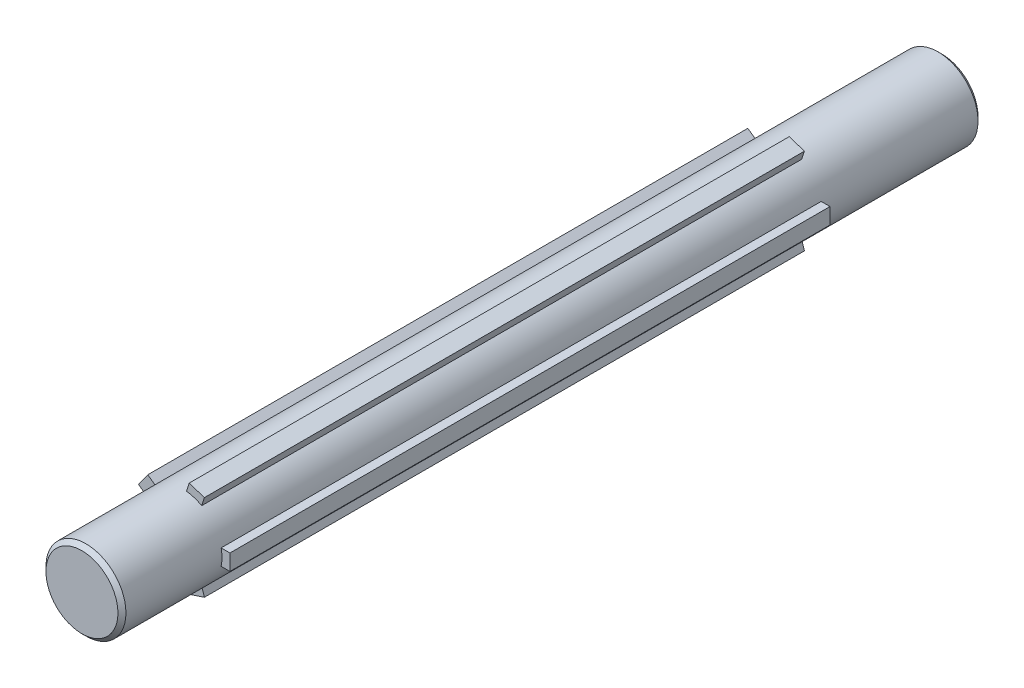
ISO-10303-21;
HEADER;
FILE_DESCRIPTION(('STEP AP214'),'2;1');
FILE_NAME('part.step','',(''),(''),'','','');
FILE_SCHEMA(('AUTOMOTIVE_DESIGN { 1 0 10303 214 1 1 1 1 }'));
ENDSEC;
DATA;
#1=APPLICATION_CONTEXT('core data for automotive mechanical design processes');
#2=APPLICATION_PROTOCOL_DEFINITION('international standard','automotive_design',2000,#1);
#3=PRODUCT_CONTEXT('',#1,'mechanical');
#4=PRODUCT('Part','Part','',(#3));
#5=PRODUCT_RELATED_PRODUCT_CATEGORY('part','',(#4));
#6=PRODUCT_DEFINITION_FORMATION('','',#4);
#7=PRODUCT_DEFINITION_CONTEXT('part definition',#1,'design');
#8=PRODUCT_DEFINITION('design','',#6,#7);
#9=PRODUCT_DEFINITION_SHAPE('','',#8);
#10=(LENGTH_UNIT() NAMED_UNIT(*) SI_UNIT(.MILLI.,.METRE.));
#11=(NAMED_UNIT(*) PLANE_ANGLE_UNIT() SI_UNIT($,.RADIAN.));
#12=(NAMED_UNIT(*) SI_UNIT($,.STERADIAN.) SOLID_ANGLE_UNIT());
#13=UNCERTAINTY_MEASURE_WITH_UNIT(LENGTH_MEASURE(1.E-05),#10,'distance_accuracy_value','');
#14=(GEOMETRIC_REPRESENTATION_CONTEXT(3) GLOBAL_UNCERTAINTY_ASSIGNED_CONTEXT((#13)) GLOBAL_UNIT_ASSIGNED_CONTEXT((#10,
#11,#12)) REPRESENTATION_CONTEXT('',''));
#15=CARTESIAN_POINT('',(0.,0.,0.));
#16=DIRECTION('',(0.,0.,1.));
#17=DIRECTION('',(1.,0.,0.));
#18=AXIS2_PLACEMENT_3D('',#15,#16,#17);
#19=CARTESIAN_POINT('',(0.,0.,190.));
#20=DIRECTION('',(0.,0.,1.));
#21=DIRECTION('',(1.,0.,0.));
#22=AXIS2_PLACEMENT_3D('',#19,#20,#21);
#23=PLANE('',#22);
#24=CARTESIAN_POINT('',(0.,0.,190.));
#25=DIRECTION('',(0.,0.,1.));
#26=DIRECTION('',(1.,0.,0.));
#27=AXIS2_PLACEMENT_3D('',#24,#25,#26);
#28=CIRCLE('',#27,10.);
#29=CARTESIAN_POINT('',(4.9298488648587,8.70037873713848,190.));
#30=VERTEX_POINT('',#29);
#31=CARTESIAN_POINT('',(1.12562279967807,9.93644671463823,190.));
#32=VERTEX_POINT('',#31);
#33=EDGE_CURVE('E280',#30,#32,#28,.T.);
#34=ORIENTED_EDGE('',*,*,#33,.F.);
#35=DIRECTION('',(0.309016994374947,0.951056516295154,0.));
#36=VECTOR('',#35,1.);
#37=CARTESIAN_POINT('',(1.90211303259021,-0.618033988749863,190.));
#38=LINE('',#37,#36);
#39=CARTESIAN_POINT('',(5.6103169650895,10.7946442067917,190.));
#40=VERTEX_POINT('',#39);
#41=EDGE_CURVE('E612',#30,#40,#38,.T.);
#42=ORIENTED_EDGE('',*,*,#41,.T.);
#43=DIRECTION('',(0.951056516295154,-0.309016994374947,0.));
#44=VECTOR('',#43,1.);
#45=CARTESIAN_POINT('',(3.70820393249929,11.4126781955416,190.));
#46=LINE('',#45,#44);
#47=CARTESIAN_POINT('',(1.80609089990888,12.0307121842915,190.));
#48=VERTEX_POINT('',#47);
#49=EDGE_CURVE('E608',#48,#40,#46,.T.);
#50=ORIENTED_EDGE('',*,*,#49,.F.);
#51=DIRECTION('',(0.309016994374947,0.951056516295154,0.));
#52=VECTOR('',#51,1.);
#53=CARTESIAN_POINT('',(-1.9021130325904,0.618033988749926,190.));
#54=LINE('',#53,#52);
#55=EDGE_CURVE('E604',#32,#48,#54,.T.);
#56=ORIENTED_EDGE('',*,*,#55,.F.);
#57=EDGE_LOOP('',(#34,#42,#50,#56));
#58=FACE_BOUND('',#57,.T.);
#59=ADVANCED_FACE('F115',(#58),#23,.T.);
#60=CARTESIAN_POINT('',(-6.75114481325018,7.37712977454818,190.));
#61=VERTEX_POINT('',#60);
#62=CARTESIAN_POINT('',(-9.10228582241994,4.1410617970483,190.));
#63=VERTEX_POINT('',#62);
#64=EDGE_CURVE('E291',#61,#63,#28,.T.);
#65=ORIENTED_EDGE('',*,*,#64,.F.);
#66=DIRECTION('',(-0.809016994374948,0.587785252292473,0.));
#67=VECTOR('',#66,1.);
#68=CARTESIAN_POINT('',(1.17557050458472,1.61803398874959,190.));
#69=LINE('',#68,#67);
#70=CARTESIAN_POINT('',(-8.53263342791445,8.67145701625913,190.));
#71=VERTEX_POINT('',#70);
#72=EDGE_CURVE('E553',#61,#71,#69,.T.);
#73=ORIENTED_EDGE('',*,*,#72,.T.);
#74=DIRECTION('',(0.587785252292473,0.809016994374948,0.));
#75=VECTOR('',#74,1.);
#76=CARTESIAN_POINT('',(-9.70820393249918,7.05342302750953,190.));
#77=LINE('',#76,#75);
#78=CARTESIAN_POINT('',(-10.8837744370843,5.43538903875934,190.));
#79=VERTEX_POINT('',#78);
#80=EDGE_CURVE('E557',#79,#71,#77,.T.);
#81=ORIENTED_EDGE('',*,*,#80,.F.);
#82=DIRECTION('',(-0.809016994374947,0.587785252292473,0.));
#83=VECTOR('',#82,1.);
#84=CARTESIAN_POINT('',(-1.17557050458517,-1.6180339887502,190.));
#85=LINE('',#84,#83);
#86=EDGE_CURVE('E562',#63,#79,#85,.T.);
#87=ORIENTED_EDGE('',*,*,#86,.F.);
#88=EDGE_LOOP('',(#65,#73,#81,#87));
#89=FACE_BOUND('',#88,.T.);
#90=ADVANCED_FACE('F442',(#89),#23,.T.);
#91=CARTESIAN_POINT('',(-9.1022858224196,-4.14106179704906,190.));
#92=VERTEX_POINT('',#91);
#93=CARTESIAN_POINT('',(-6.75114481324956,-7.37712977454874,190.));
#94=VERTEX_POINT('',#93);
#95=EDGE_CURVE('E284',#92,#94,#28,.T.);
#96=ORIENTED_EDGE('',*,*,#95,.F.);
#97=DIRECTION('',(-0.809016994374947,-0.587785252292474,0.));
#98=VECTOR('',#97,1.);
#99=CARTESIAN_POINT('',(-1.17557050458469,1.61803398874954,190.));
#100=LINE('',#99,#98);
#101=CARTESIAN_POINT('',(-10.8837744370841,-5.43538903876016,190.));
#102=VERTEX_POINT('',#101);
#103=EDGE_CURVE('E319',#92,#102,#100,.T.);
#104=ORIENTED_EDGE('',*,*,#103,.T.);
#105=DIRECTION('',(-0.587785252292473,0.809016994374947,0.));
#106=VECTOR('',#105,1.);
#107=CARTESIAN_POINT('',(-9.7082039324994,-7.05342302750969,190.));
#108=LINE('',#107,#106);
#109=CARTESIAN_POINT('',(-8.53263342791418,-8.67145701625995,190.));
#110=VERTEX_POINT('',#109);
#111=EDGE_CURVE('E324',#110,#102,#108,.T.);
#112=ORIENTED_EDGE('',*,*,#111,.F.);
#113=DIRECTION('',(-0.809016994374947,-0.587785252292473,0.));
#114=VECTOR('',#113,1.);
#115=CARTESIAN_POINT('',(1.17557050458521,-1.61803398875025,190.));
#116=LINE('',#115,#114);
#117=EDGE_CURVE('E322',#94,#110,#116,.T.);
#118=ORIENTED_EDGE('',*,*,#117,.F.);
#119=EDGE_LOOP('',(#96,#104,#112,#118));
#120=FACE_BOUND('',#119,.T.);
#121=ADVANCED_FACE('F317',(#120),#23,.T.);
#122=CARTESIAN_POINT('',(1.12562279967839,-9.93644671463819,190.));
#123=VERTEX_POINT('',#122);
#124=CARTESIAN_POINT('',(4.92984886485898,-8.70037873713832,190.));
#125=VERTEX_POINT('',#124);
#126=EDGE_CURVE('E277',#123,#125,#28,.T.);
#127=ORIENTED_EDGE('',*,*,#126,.F.);
#128=DIRECTION('',(0.309016994374948,-0.951056516295154,0.));
#129=VECTOR('',#128,1.);
#130=CARTESIAN_POINT('',(-1.90211303259011,-0.61803398874983,190.));
#131=LINE('',#130,#129);
#132=CARTESIAN_POINT('',(1.80609089990932,-12.0307121842918,190.));
#133=VERTEX_POINT('',#132);
#134=EDGE_CURVE('E356',#123,#133,#131,.T.);
#135=ORIENTED_EDGE('',*,*,#134,.T.);
#136=DIRECTION('',(-0.951056516295154,-0.309016994374948,0.));
#137=VECTOR('',#136,1.);
#138=CARTESIAN_POINT('',(3.70820393249942,-11.412678195542,190.));
#139=LINE('',#138,#137);
#140=CARTESIAN_POINT('',(5.61031696508993,-10.7946442067921,190.));
#141=VERTEX_POINT('',#140);
#142=EDGE_CURVE('E359',#141,#133,#139,.T.);
#143=ORIENTED_EDGE('',*,*,#142,.F.);
#144=DIRECTION('',(0.309016994374948,-0.951056516295154,0.));
#145=VECTOR('',#144,1.);
#146=CARTESIAN_POINT('',(1.90211303259051,0.61803398874996,190.));
#147=LINE('',#146,#145);
#148=EDGE_CURVE('E364',#125,#141,#147,.T.);
#149=ORIENTED_EDGE('',*,*,#148,.F.);
#150=EDGE_LOOP('',(#127,#135,#143,#149));
#151=FACE_BOUND('',#150,.T.);
#152=ADVANCED_FACE('F451',(#151),#23,.T.);
#153=CARTESIAN_POINT('',(0.,0.,40.));
#154=DIRECTION('',(0.,0.,-1.));
#155=DIRECTION('',(-1.,0.,0.));
#156=AXIS2_PLACEMENT_3D('',#153,#154,#155);
#157=CYLINDRICAL_SURFACE('',#156,10.);
#158=CARTESIAN_POINT('',(0.,0.,214.));
#159=DIRECTION('',(0.,0.,1.));
#160=DIRECTION('',(1.,0.,0.));
#161=AXIS2_PLACEMENT_3D('',#158,#159,#160);
#162=CIRCLE('',#161,10.);
#163=CARTESIAN_POINT('',(10.,0.,214.));
#164=VERTEX_POINT('',#163);
#165=EDGE_CURVE('E124',#164,#164,#162,.F.);
#166=ORIENTED_EDGE('',*,*,#165,.T.);
#167=EDGE_LOOP('',(#166));
#168=FACE_BOUND('',#167,.T.);
#169=CARTESIAN_POINT('',(0.,0.,0.99999999999998));
#170=DIRECTION('',(0.,0.,1.));
#171=DIRECTION('',(1.,0.,0.));
#172=AXIS2_PLACEMENT_3D('',#169,#170,#171);
#173=CIRCLE('',#172,10.);
#174=CARTESIAN_POINT('',(10.,0.,0.99999999999998));
#175=VERTEX_POINT('',#174);
#176=EDGE_CURVE('E298',#175,#175,#173,.T.);
#177=ORIENTED_EDGE('',*,*,#176,.T.);
#178=EDGE_LOOP('',(#177));
#179=FACE_BOUND('',#178,.T.);
#180=DIRECTION('',(0.,0.,-1.));
#181=VECTOR('',#180,1.);
#182=CARTESIAN_POINT('',(4.9298488648587,8.70037873713848,190.));
#183=LINE('',#182,#181);
#184=CARTESIAN_POINT('',(4.9298488648587,8.70037873713848,40.));
#185=VERTEX_POINT('',#184);
#186=EDGE_CURVE('E412',#30,#185,#183,.T.);
#187=ORIENTED_EDGE('',*,*,#186,.F.);
#188=ORIENTED_EDGE('',*,*,#33,.T.);
#189=DIRECTION('',(0.,0.,-1.));
#190=VECTOR('',#189,1.);
#191=CARTESIAN_POINT('',(1.12562279967807,9.93644671463823,190.));
#192=LINE('',#191,#190);
#193=CARTESIAN_POINT('',(1.12562279967807,9.93644671463823,40.));
#194=VERTEX_POINT('',#193);
#195=EDGE_CURVE('E601',#32,#194,#192,.T.);
#196=ORIENTED_EDGE('',*,*,#195,.T.);
#197=CARTESIAN_POINT('',(0.,0.,40.));
#198=DIRECTION('',(0.,0.,1.));
#199=DIRECTION('',(1.,0.,0.));
#200=AXIS2_PLACEMENT_3D('',#197,#198,#199);
#201=CIRCLE('',#200,10.);
#202=EDGE_CURVE('E278',#185,#194,#201,.T.);
#203=ORIENTED_EDGE('',*,*,#202,.F.);
#204=EDGE_LOOP('',(#187,#188,#196,#203));
#205=FACE_BOUND('',#204,.T.);
#206=DIRECTION('',(0.,0.,-1.));
#207=VECTOR('',#206,1.);
#208=CARTESIAN_POINT('',(-6.75114481325018,7.37712977454818,190.));
#209=LINE('',#208,#207);
#210=CARTESIAN_POINT('',(-6.75114481325018,7.37712977454818,40.));
#211=VERTEX_POINT('',#210);
#212=EDGE_CURVE('E544',#61,#211,#209,.T.);
#213=ORIENTED_EDGE('',*,*,#212,.F.);
#214=ORIENTED_EDGE('',*,*,#64,.T.);
#215=DIRECTION('',(0.,0.,-1.));
#216=VECTOR('',#215,1.);
#217=CARTESIAN_POINT('',(-9.10228582241994,4.1410617970483,190.));
#218=LINE('',#217,#216);
#219=CARTESIAN_POINT('',(-9.10228582241994,4.1410617970483,40.));
#220=VERTEX_POINT('',#219);
#221=EDGE_CURVE('E573',#63,#220,#218,.T.);
#222=ORIENTED_EDGE('',*,*,#221,.T.);
#223=EDGE_CURVE('E285',#211,#220,#201,.T.);
#224=ORIENTED_EDGE('',*,*,#223,.F.);
#225=EDGE_LOOP('',(#213,#214,#222,#224));
#226=FACE_BOUND('',#225,.T.);
#227=DIRECTION('',(0.,0.,-1.));
#228=VECTOR('',#227,1.);
#229=CARTESIAN_POINT('',(-9.1022858224196,-4.14106179704906,190.));
#230=LINE('',#229,#228);
#231=CARTESIAN_POINT('',(-9.1022858224196,-4.14106179704906,40.));
#232=VERTEX_POINT('',#231);
#233=EDGE_CURVE('E313',#92,#232,#230,.T.);
#234=ORIENTED_EDGE('',*,*,#233,.F.);
#235=ORIENTED_EDGE('',*,*,#95,.T.);
#236=DIRECTION('',(0.,0.,-1.));
#237=VECTOR('',#236,1.);
#238=CARTESIAN_POINT('',(-6.75114481324956,-7.37712977454874,190.));
#239=LINE('',#238,#237);
#240=CARTESIAN_POINT('',(-6.75114481324956,-7.37712977454874,40.));
#241=VERTEX_POINT('',#240);
#242=EDGE_CURVE('E310',#94,#241,#239,.T.);
#243=ORIENTED_EDGE('',*,*,#242,.T.);
#244=EDGE_CURVE('E591',#232,#241,#201,.T.);
#245=ORIENTED_EDGE('',*,*,#244,.F.);
#246=EDGE_LOOP('',(#234,#235,#243,#245));
#247=FACE_BOUND('',#246,.T.);
#248=DIRECTION('',(0.,0.,-1.));
#249=VECTOR('',#248,1.);
#250=CARTESIAN_POINT('',(1.12562279967839,-9.93644671463819,190.));
#251=LINE('',#250,#249);
#252=CARTESIAN_POINT('',(1.12562279967839,-9.93644671463819,40.));
#253=VERTEX_POINT('',#252);
#254=EDGE_CURVE('E340',#123,#253,#251,.T.);
#255=ORIENTED_EDGE('',*,*,#254,.F.);
#256=ORIENTED_EDGE('',*,*,#126,.T.);
#257=DIRECTION('',(0.,0.,-1.));
#258=VECTOR('',#257,1.);
#259=CARTESIAN_POINT('',(4.92984886485898,-8.70037873713832,190.));
#260=LINE('',#259,#258);
#261=CARTESIAN_POINT('',(4.92984886485898,-8.70037873713832,40.));
#262=VERTEX_POINT('',#261);
#263=EDGE_CURVE('E368',#125,#262,#260,.T.);
#264=ORIENTED_EDGE('',*,*,#263,.T.);
#265=EDGE_CURVE('E139',#253,#262,#201,.T.);
#266=ORIENTED_EDGE('',*,*,#265,.F.);
#267=EDGE_LOOP('',(#255,#256,#264,#266));
#268=FACE_BOUND('',#267,.T.);
#269=CARTESIAN_POINT('',(9.79795897113271,-2.,190.));
#270=VERTEX_POINT('',#269);
#271=CARTESIAN_POINT('',(9.79795897113271,2.,190.));
#272=VERTEX_POINT('',#271);
#273=EDGE_CURVE('E259',#270,#272,#28,.T.);
#274=ORIENTED_EDGE('',*,*,#273,.T.);
#275=DIRECTION('',(0.,0.,-1.));
#276=VECTOR('',#275,1.);
#277=CARTESIAN_POINT('',(9.79795897113271,2.,190.));
#278=LINE('',#277,#276);
#279=CARTESIAN_POINT('',(9.79795897113271,2.,40.));
#280=VERTEX_POINT('',#279);
#281=EDGE_CURVE('E264',#272,#280,#278,.T.);
#282=ORIENTED_EDGE('',*,*,#281,.T.);
#283=CARTESIAN_POINT('',(9.79795897113271,-2.,40.));
#284=VERTEX_POINT('',#283);
#285=EDGE_CURVE('E131',#284,#280,#201,.T.);
#286=ORIENTED_EDGE('',*,*,#285,.F.);
#287=DIRECTION('',(0.,0.,-1.));
#288=VECTOR('',#287,1.);
#289=CARTESIAN_POINT('',(9.79795897113271,-2.,190.));
#290=LINE('',#289,#288);
#291=EDGE_CURVE('E274',#270,#284,#290,.T.);
#292=ORIENTED_EDGE('',*,*,#291,.F.);
#293=EDGE_LOOP('',(#274,#282,#286,#292));
#294=FACE_BOUND('',#293,.T.);
#295=ADVANCED_FACE('F273',(#168,#179,#205,#226,#247,#268,#294),#157,.T.);
#296=CARTESIAN_POINT('',(0.,0.,0.));
#297=DIRECTION('',(0.,0.,1.));
#298=DIRECTION('',(1.,0.,0.));
#299=AXIS2_PLACEMENT_3D('',#296,#297,#298);
#300=PLANE('',#299);
#301=CARTESIAN_POINT('',(0.,0.,0.));
#302=DIRECTION('',(0.,0.,1.));
#303=DIRECTION('',(1.,0.,0.));
#304=AXIS2_PLACEMENT_3D('',#301,#302,#303);
#305=CIRCLE('',#304,9.00000000000001);
#306=CARTESIAN_POINT('',(9.00000000000001,0.,0.));
#307=VERTEX_POINT('',#306);
#308=EDGE_CURVE('E12',#307,#307,#305,.F.);
#309=ORIENTED_EDGE('',*,*,#308,.T.);
#310=EDGE_LOOP('',(#309));
#311=FACE_BOUND('',#310,.T.);
#312=ADVANCED_FACE('F468',(#311),#300,.F.);
#313=CARTESIAN_POINT('',(0.,0.,40.));
#314=DIRECTION('',(0.,0.,1.));
#315=DIRECTION('',(1.,0.,0.));
#316=AXIS2_PLACEMENT_3D('',#313,#314,#315);
#317=PLANE('',#316);
#318=DIRECTION('',(0.309016994374947,0.951056516295154,0.));
#319=VECTOR('',#318,1.);
#320=CARTESIAN_POINT('',(1.90211303259021,-0.618033988749863,40.));
#321=LINE('',#320,#319);
#322=CARTESIAN_POINT('',(5.6103169650895,10.7946442067917,40.));
#323=VERTEX_POINT('',#322);
#324=EDGE_CURVE('E549',#185,#323,#321,.T.);
#325=ORIENTED_EDGE('',*,*,#324,.F.);
#326=ORIENTED_EDGE('',*,*,#202,.T.);
#327=DIRECTION('',(0.309016994374947,0.951056516295154,0.));
#328=VECTOR('',#327,1.);
#329=CARTESIAN_POINT('',(-1.9021130325904,0.618033988749926,40.));
#330=LINE('',#329,#328);
#331=CARTESIAN_POINT('',(1.80609089990888,12.0307121842915,40.));
#332=VERTEX_POINT('',#331);
#333=EDGE_CURVE('E615',#194,#332,#330,.T.);
#334=ORIENTED_EDGE('',*,*,#333,.T.);
#335=DIRECTION('',(0.951056516295154,-0.309016994374947,0.));
#336=VECTOR('',#335,1.);
#337=CARTESIAN_POINT('',(3.70820393249929,11.4126781955416,40.));
#338=LINE('',#337,#336);
#339=EDGE_CURVE('E618',#332,#323,#338,.T.);
#340=ORIENTED_EDGE('',*,*,#339,.T.);
#341=EDGE_LOOP('',(#325,#326,#334,#340));
#342=FACE_BOUND('',#341,.T.);
#343=ADVANCED_FACE('F493',(#342),#317,.F.);
#344=DIRECTION('',(-0.809016994374948,0.587785252292473,0.));
#345=VECTOR('',#344,1.);
#346=CARTESIAN_POINT('',(1.17557050458472,1.61803398874959,40.));
#347=LINE('',#346,#345);
#348=CARTESIAN_POINT('',(-8.53263342791445,8.67145701625913,40.));
#349=VERTEX_POINT('',#348);
#350=EDGE_CURVE('E355',#211,#349,#347,.T.);
#351=ORIENTED_EDGE('',*,*,#350,.F.);
#352=ORIENTED_EDGE('',*,*,#223,.T.);
#353=DIRECTION('',(-0.809016994374947,0.587785252292473,0.));
#354=VECTOR('',#353,1.);
#355=CARTESIAN_POINT('',(-1.17557050458517,-1.6180339887502,40.));
#356=LINE('',#355,#354);
#357=CARTESIAN_POINT('',(-10.8837744370843,5.43538903875934,40.));
#358=VERTEX_POINT('',#357);
#359=EDGE_CURVE('E558',#220,#358,#356,.T.);
#360=ORIENTED_EDGE('',*,*,#359,.T.);
#361=DIRECTION('',(0.587785252292473,0.809016994374948,0.));
#362=VECTOR('',#361,1.);
#363=CARTESIAN_POINT('',(-9.70820393249918,7.05342302750953,40.));
#364=LINE('',#363,#362);
#365=EDGE_CURVE('E565',#358,#349,#364,.T.);
#366=ORIENTED_EDGE('',*,*,#365,.T.);
#367=EDGE_LOOP('',(#351,#352,#360,#366));
#368=FACE_BOUND('',#367,.T.);
#369=ADVANCED_FACE('F494',(#368),#317,.F.);
#370=DIRECTION('',(-0.809016994374947,-0.587785252292474,0.));
#371=VECTOR('',#370,1.);
#372=CARTESIAN_POINT('',(-1.17557050458469,1.61803398874954,40.));
#373=LINE('',#372,#371);
#374=CARTESIAN_POINT('',(-10.8837744370841,-5.43538903876016,40.));
#375=VERTEX_POINT('',#374);
#376=EDGE_CURVE('E335',#232,#375,#373,.T.);
#377=ORIENTED_EDGE('',*,*,#376,.F.);
#378=ORIENTED_EDGE('',*,*,#244,.T.);
#379=DIRECTION('',(-0.809016994374947,-0.587785252292473,0.));
#380=VECTOR('',#379,1.);
#381=CARTESIAN_POINT('',(1.17557050458521,-1.61803398875025,40.));
#382=LINE('',#381,#380);
#383=CARTESIAN_POINT('',(-8.53263342791418,-8.67145701625995,40.));
#384=VERTEX_POINT('',#383);
#385=EDGE_CURVE('E344',#241,#384,#382,.T.);
#386=ORIENTED_EDGE('',*,*,#385,.T.);
#387=DIRECTION('',(-0.587785252292473,0.809016994374947,0.));
#388=VECTOR('',#387,1.);
#389=CARTESIAN_POINT('',(-9.7082039324994,-7.05342302750969,40.));
#390=LINE('',#389,#388);
#391=EDGE_CURVE('E339',#384,#375,#390,.T.);
#392=ORIENTED_EDGE('',*,*,#391,.T.);
#393=EDGE_LOOP('',(#377,#378,#386,#392));
#394=FACE_BOUND('',#393,.T.);
#395=ADVANCED_FACE('F486',(#394),#317,.F.);
#396=DIRECTION('',(0.309016994374948,-0.951056516295154,0.));
#397=VECTOR('',#396,1.);
#398=CARTESIAN_POINT('',(-1.90211303259011,-0.61803398874983,40.));
#399=LINE('',#398,#397);
#400=CARTESIAN_POINT('',(1.80609089990932,-12.0307121842918,40.));
#401=VERTEX_POINT('',#400);
#402=EDGE_CURVE('E369',#253,#401,#399,.T.);
#403=ORIENTED_EDGE('',*,*,#402,.F.);
#404=ORIENTED_EDGE('',*,*,#265,.T.);
#405=DIRECTION('',(0.309016994374948,-0.951056516295154,0.));
#406=VECTOR('',#405,1.);
#407=CARTESIAN_POINT('',(1.90211303259051,0.61803398874996,40.));
#408=LINE('',#407,#406);
#409=CARTESIAN_POINT('',(5.61031696508993,-10.7946442067921,40.));
#410=VERTEX_POINT('',#409);
#411=EDGE_CURVE('E360',#262,#410,#408,.T.);
#412=ORIENTED_EDGE('',*,*,#411,.T.);
#413=DIRECTION('',(-0.951056516295154,-0.309016994374948,0.));
#414=VECTOR('',#413,1.);
#415=CARTESIAN_POINT('',(3.70820393249942,-11.412678195542,40.));
#416=LINE('',#415,#414);
#417=EDGE_CURVE('E373',#410,#401,#416,.T.);
#418=ORIENTED_EDGE('',*,*,#417,.T.);
#419=EDGE_LOOP('',(#403,#404,#412,#418));
#420=FACE_BOUND('',#419,.T.);
#421=ADVANCED_FACE('F483',(#420),#317,.F.);
#422=DIRECTION('',(1.,0.,0.));
#423=VECTOR('',#422,1.);
#424=CARTESIAN_POINT('',(0.,-2.,40.));
#425=LINE('',#424,#423);
#426=CARTESIAN_POINT('',(12.,-2.,40.));
#427=VERTEX_POINT('',#426);
#428=EDGE_CURVE('E395',#284,#427,#425,.T.);
#429=ORIENTED_EDGE('',*,*,#428,.F.);
#430=ORIENTED_EDGE('',*,*,#285,.T.);
#431=DIRECTION('',(1.,0.,0.));
#432=VECTOR('',#431,1.);
#433=CARTESIAN_POINT('',(0.,2.,40.));
#434=LINE('',#433,#432);
#435=CARTESIAN_POINT('',(12.,2.,40.));
#436=VERTEX_POINT('',#435);
#437=EDGE_CURVE('E269',#280,#436,#434,.T.);
#438=ORIENTED_EDGE('',*,*,#437,.T.);
#439=DIRECTION('',(0.,-1.,0.));
#440=VECTOR('',#439,1.);
#441=CARTESIAN_POINT('',(12.,0.,40.));
#442=LINE('',#441,#440);
#443=EDGE_CURVE('E399',#436,#427,#442,.T.);
#444=ORIENTED_EDGE('',*,*,#443,.T.);
#445=EDGE_LOOP('',(#429,#430,#438,#444));
#446=FACE_BOUND('',#445,.T.);
#447=ADVANCED_FACE('F485',(#446),#317,.F.);
#448=CARTESIAN_POINT('',(1.90211303259021,-0.618033988749863,190.));
#449=DIRECTION('',(-0.951056516295154,0.309016994374947,0.));
#450=DIRECTION('',(-0.309016994374947,-0.951056516295154,0.));
#451=AXIS2_PLACEMENT_3D('',#448,#449,#450);
#452=PLANE('',#451);
#453=ORIENTED_EDGE('',*,*,#324,.T.);
#454=DIRECTION('',(0.,0.,-1.));
#455=VECTOR('',#454,1.);
#456=CARTESIAN_POINT('',(5.6103169650895,10.7946442067917,190.));
#457=LINE('',#456,#455);
#458=EDGE_CURVE('E597',#40,#323,#457,.T.);
#459=ORIENTED_EDGE('',*,*,#458,.F.);
#460=ORIENTED_EDGE('',*,*,#41,.F.);
#461=ORIENTED_EDGE('',*,*,#186,.T.);
#462=EDGE_LOOP('',(#453,#459,#460,#461));
#463=FACE_BOUND('',#462,.T.);
#464=ADVANCED_FACE('F491',(#463),#452,.F.);
#465=CARTESIAN_POINT('',(3.70820393249929,11.4126781955416,190.));
#466=DIRECTION('',(0.309016994374947,0.951056516295154,0.));
#467=DIRECTION('',(-0.951056516295154,0.309016994374947,0.));
#468=AXIS2_PLACEMENT_3D('',#465,#466,#467);
#469=PLANE('',#468);
#470=ORIENTED_EDGE('',*,*,#339,.F.);
#471=DIRECTION('',(0.,0.,-1.));
#472=VECTOR('',#471,1.);
#473=CARTESIAN_POINT('',(1.80609089990888,12.0307121842915,190.));
#474=LINE('',#473,#472);
#475=EDGE_CURVE('E599',#48,#332,#474,.T.);
#476=ORIENTED_EDGE('',*,*,#475,.F.);
#477=ORIENTED_EDGE('',*,*,#49,.T.);
#478=ORIENTED_EDGE('',*,*,#458,.T.);
#479=EDGE_LOOP('',(#470,#476,#477,#478));
#480=FACE_BOUND('',#479,.T.);
#481=ADVANCED_FACE('F459',(#480),#469,.T.);
#482=CARTESIAN_POINT('',(-1.9021130325904,0.618033988749926,190.));
#483=DIRECTION('',(-0.951056516295154,0.309016994374947,0.));
#484=DIRECTION('',(-0.309016994374947,-0.951056516295154,0.));
#485=AXIS2_PLACEMENT_3D('',#482,#483,#484);
#486=PLANE('',#485);
#487=ORIENTED_EDGE('',*,*,#333,.F.);
#488=ORIENTED_EDGE('',*,*,#195,.F.);
#489=ORIENTED_EDGE('',*,*,#55,.T.);
#490=ORIENTED_EDGE('',*,*,#475,.T.);
#491=EDGE_LOOP('',(#487,#488,#489,#490));
#492=FACE_BOUND('',#491,.T.);
#493=ADVANCED_FACE('F450',(#492),#486,.T.);
#494=ORIENTED_EDGE('',*,*,#273,.F.);
#495=DIRECTION('',(1.,0.,0.));
#496=VECTOR('',#495,1.);
#497=CARTESIAN_POINT('',(0.,-2.,190.));
#498=LINE('',#497,#496);
#499=CARTESIAN_POINT('',(12.,-2.,190.));
#500=VERTEX_POINT('',#499);
#501=EDGE_CURVE('E390',#270,#500,#498,.T.);
#502=ORIENTED_EDGE('',*,*,#501,.T.);
#503=DIRECTION('',(0.,-1.,0.));
#504=VECTOR('',#503,1.);
#505=CARTESIAN_POINT('',(12.,0.,190.));
#506=LINE('',#505,#504);
#507=CARTESIAN_POINT('',(12.,2.,190.));
#508=VERTEX_POINT('',#507);
#509=EDGE_CURVE('E261',#508,#500,#506,.T.);
#510=ORIENTED_EDGE('',*,*,#509,.F.);
#511=DIRECTION('',(1.,0.,0.));
#512=VECTOR('',#511,1.);
#513=CARTESIAN_POINT('',(0.,2.,190.));
#514=LINE('',#513,#512);
#515=EDGE_CURVE('E255',#272,#508,#514,.T.);
#516=ORIENTED_EDGE('',*,*,#515,.F.);
#517=EDGE_LOOP('',(#494,#502,#510,#516));
#518=FACE_BOUND('',#517,.T.);
#519=ADVANCED_FACE('F257',(#518),#23,.T.);
#520=CARTESIAN_POINT('',(-9.70820393249918,7.05342302750953,190.));
#521=DIRECTION('',(-0.809016994374948,0.587785252292473,0.));
#522=DIRECTION('',(-0.587785252292473,-0.809016994374948,0.));
#523=AXIS2_PLACEMENT_3D('',#520,#521,#522);
#524=PLANE('',#523);
#525=ORIENTED_EDGE('',*,*,#365,.F.);
#526=DIRECTION('',(0.,0.,-1.));
#527=VECTOR('',#526,1.);
#528=CARTESIAN_POINT('',(-10.8837744370843,5.43538903875934,190.));
#529=LINE('',#528,#527);
#530=EDGE_CURVE('E581',#79,#358,#529,.T.);
#531=ORIENTED_EDGE('',*,*,#530,.F.);
#532=ORIENTED_EDGE('',*,*,#80,.T.);
#533=DIRECTION('',(0.,0.,-1.));
#534=VECTOR('',#533,1.);
#535=CARTESIAN_POINT('',(-8.53263342791445,8.67145701625913,190.));
#536=LINE('',#535,#534);
#537=EDGE_CURVE('E550',#71,#349,#536,.T.);
#538=ORIENTED_EDGE('',*,*,#537,.T.);
#539=EDGE_LOOP('',(#525,#531,#532,#538));
#540=FACE_BOUND('',#539,.T.);
#541=ADVANCED_FACE('F436',(#540),#524,.T.);
#542=CARTESIAN_POINT('',(-1.17557050458517,-1.6180339887502,190.));
#543=DIRECTION('',(-0.587785252292473,-0.809016994374947,0.));
#544=DIRECTION('',(0.809016994374947,-0.587785252292473,0.));
#545=AXIS2_PLACEMENT_3D('',#542,#543,#544);
#546=PLANE('',#545);
#547=ORIENTED_EDGE('',*,*,#359,.F.);
#548=ORIENTED_EDGE('',*,*,#221,.F.);
#549=ORIENTED_EDGE('',*,*,#86,.T.);
#550=ORIENTED_EDGE('',*,*,#530,.T.);
#551=EDGE_LOOP('',(#547,#548,#549,#550));
#552=FACE_BOUND('',#551,.T.);
#553=ADVANCED_FACE('F456',(#552),#546,.T.);
#554=CARTESIAN_POINT('',(-1.17557050458469,1.61803398874954,190.));
#555=DIRECTION('',(0.587785252292474,-0.809016994374947,0.));
#556=DIRECTION('',(0.809016994374947,0.587785252292474,0.));
#557=AXIS2_PLACEMENT_3D('',#554,#555,#556);
#558=PLANE('',#557);
#559=ORIENTED_EDGE('',*,*,#376,.T.);
#560=DIRECTION('',(0.,0.,-1.));
#561=VECTOR('',#560,1.);
#562=CARTESIAN_POINT('',(-10.8837744370841,-5.43538903876016,190.));
#563=LINE('',#562,#561);
#564=EDGE_CURVE('E350',#102,#375,#563,.T.);
#565=ORIENTED_EDGE('',*,*,#564,.F.);
#566=ORIENTED_EDGE('',*,*,#103,.F.);
#567=ORIENTED_EDGE('',*,*,#233,.T.);
#568=EDGE_LOOP('',(#559,#565,#566,#567));
#569=FACE_BOUND('',#568,.T.);
#570=ADVANCED_FACE('F506',(#569),#558,.F.);
#571=CARTESIAN_POINT('',(-9.7082039324994,-7.05342302750969,190.));
#572=DIRECTION('',(-0.809016994374948,-0.587785252292473,0.));
#573=DIRECTION('',(0.587785252292473,-0.809016994374948,0.));
#574=AXIS2_PLACEMENT_3D('',#571,#572,#573);
#575=PLANE('',#574);
#576=ORIENTED_EDGE('',*,*,#391,.F.);
#577=DIRECTION('',(0.,0.,-1.));
#578=VECTOR('',#577,1.);
#579=CARTESIAN_POINT('',(-8.53263342791418,-8.67145701625995,190.));
#580=LINE('',#579,#578);
#581=EDGE_CURVE('E330',#110,#384,#580,.T.);
#582=ORIENTED_EDGE('',*,*,#581,.F.);
#583=ORIENTED_EDGE('',*,*,#111,.T.);
#584=ORIENTED_EDGE('',*,*,#564,.T.);
#585=EDGE_LOOP('',(#576,#582,#583,#584));
#586=FACE_BOUND('',#585,.T.);
#587=ADVANCED_FACE('F512',(#586),#575,.T.);
#588=CARTESIAN_POINT('',(1.17557050458521,-1.61803398875025,190.));
#589=DIRECTION('',(0.587785252292473,-0.809016994374947,0.));
#590=DIRECTION('',(0.809016994374947,0.587785252292473,0.));
#591=AXIS2_PLACEMENT_3D('',#588,#589,#590);
#592=PLANE('',#591);
#593=ORIENTED_EDGE('',*,*,#385,.F.);
#594=ORIENTED_EDGE('',*,*,#242,.F.);
#595=ORIENTED_EDGE('',*,*,#117,.T.);
#596=ORIENTED_EDGE('',*,*,#581,.T.);
#597=EDGE_LOOP('',(#593,#594,#595,#596));
#598=FACE_BOUND('',#597,.T.);
#599=ADVANCED_FACE('F509',(#598),#592,.T.);
#600=CARTESIAN_POINT('',(-1.90211303259011,-0.61803398874983,190.));
#601=DIRECTION('',(0.951056516295153,0.309016994374948,0.));
#602=DIRECTION('',(-0.309016994374948,0.951056516295154,0.));
#603=AXIS2_PLACEMENT_3D('',#600,#601,#602);
#604=PLANE('',#603);
#605=ORIENTED_EDGE('',*,*,#402,.T.);
#606=DIRECTION('',(0.,0.,-1.));
#607=VECTOR('',#606,1.);
#608=CARTESIAN_POINT('',(1.80609089990932,-12.0307121842918,190.));
#609=LINE('',#608,#607);
#610=EDGE_CURVE('E384',#133,#401,#609,.T.);
#611=ORIENTED_EDGE('',*,*,#610,.F.);
#612=ORIENTED_EDGE('',*,*,#134,.F.);
#613=ORIENTED_EDGE('',*,*,#254,.T.);
#614=EDGE_LOOP('',(#605,#611,#612,#613));
#615=FACE_BOUND('',#614,.T.);
#616=ADVANCED_FACE('F476',(#615),#604,.F.);
#617=CARTESIAN_POINT('',(3.70820393249942,-11.412678195542,190.));
#618=DIRECTION('',(0.309016994374947,-0.951056516295154,0.));
#619=DIRECTION('',(0.951056516295154,0.309016994374947,0.));
#620=AXIS2_PLACEMENT_3D('',#617,#618,#619);
#621=PLANE('',#620);
#622=ORIENTED_EDGE('',*,*,#417,.F.);
#623=DIRECTION('',(0.,0.,-1.));
#624=VECTOR('',#623,1.);
#625=CARTESIAN_POINT('',(5.61031696508993,-10.7946442067921,190.));
#626=LINE('',#625,#624);
#627=EDGE_CURVE('E381',#141,#410,#626,.T.);
#628=ORIENTED_EDGE('',*,*,#627,.F.);
#629=ORIENTED_EDGE('',*,*,#142,.T.);
#630=ORIENTED_EDGE('',*,*,#610,.T.);
#631=EDGE_LOOP('',(#622,#628,#629,#630));
#632=FACE_BOUND('',#631,.T.);
#633=ADVANCED_FACE('F479',(#632),#621,.T.);
#634=CARTESIAN_POINT('',(1.90211303259051,0.61803398874996,190.));
#635=DIRECTION('',(0.951056516295154,0.309016994374947,0.));
#636=DIRECTION('',(-0.309016994374947,0.951056516295154,0.));
#637=AXIS2_PLACEMENT_3D('',#634,#635,#636);
#638=PLANE('',#637);
#639=ORIENTED_EDGE('',*,*,#411,.F.);
#640=ORIENTED_EDGE('',*,*,#263,.F.);
#641=ORIENTED_EDGE('',*,*,#148,.T.);
#642=ORIENTED_EDGE('',*,*,#627,.T.);
#643=EDGE_LOOP('',(#639,#640,#641,#642));
#644=FACE_BOUND('',#643,.T.);
#645=ADVANCED_FACE('F482',(#644),#638,.T.);
#646=CARTESIAN_POINT('',(0.,-2.,190.));
#647=DIRECTION('',(0.,1.,0.));
#648=DIRECTION('',(0.,0.,1.));
#649=AXIS2_PLACEMENT_3D('',#646,#647,#648);
#650=PLANE('',#649);
#651=ORIENTED_EDGE('',*,*,#428,.T.);
#652=DIRECTION('',(0.,0.,-1.));
#653=VECTOR('',#652,1.);
#654=CARTESIAN_POINT('',(12.,-2.,190.));
#655=LINE('',#654,#653);
#656=EDGE_CURVE('E407',#500,#427,#655,.T.);
#657=ORIENTED_EDGE('',*,*,#656,.F.);
#658=ORIENTED_EDGE('',*,*,#501,.F.);
#659=ORIENTED_EDGE('',*,*,#291,.T.);
#660=EDGE_LOOP('',(#651,#657,#658,#659));
#661=FACE_BOUND('',#660,.T.);
#662=ADVANCED_FACE('F521',(#661),#650,.F.);
#663=CARTESIAN_POINT('',(12.,0.,190.));
#664=DIRECTION('',(1.,0.,0.));
#665=DIRECTION('',(0.,0.,-1.));
#666=AXIS2_PLACEMENT_3D('',#663,#664,#665);
#667=PLANE('',#666);
#668=ORIENTED_EDGE('',*,*,#443,.F.);
#669=DIRECTION('',(0.,0.,-1.));
#670=VECTOR('',#669,1.);
#671=CARTESIAN_POINT('',(12.,2.,190.));
#672=LINE('',#671,#670);
#673=EDGE_CURVE('E271',#508,#436,#672,.T.);
#674=ORIENTED_EDGE('',*,*,#673,.F.);
#675=ORIENTED_EDGE('',*,*,#509,.T.);
#676=ORIENTED_EDGE('',*,*,#656,.T.);
#677=EDGE_LOOP('',(#668,#674,#675,#676));
#678=FACE_BOUND('',#677,.T.);
#679=ADVANCED_FACE('F439',(#678),#667,.T.);
#680=CARTESIAN_POINT('',(0.,2.,190.));
#681=DIRECTION('',(0.,1.,0.));
#682=DIRECTION('',(0.,0.,1.));
#683=AXIS2_PLACEMENT_3D('',#680,#681,#682);
#684=PLANE('',#683);
#685=ORIENTED_EDGE('',*,*,#437,.F.);
#686=ORIENTED_EDGE('',*,*,#281,.F.);
#687=ORIENTED_EDGE('',*,*,#515,.T.);
#688=ORIENTED_EDGE('',*,*,#673,.T.);
#689=EDGE_LOOP('',(#685,#686,#687,#688));
#690=FACE_BOUND('',#689,.T.);
#691=ADVANCED_FACE('F267',(#690),#684,.T.);
#692=CARTESIAN_POINT('',(1.17557050458472,1.61803398874959,190.));
#693=DIRECTION('',(-0.587785252292473,-0.809016994374947,0.));
#694=DIRECTION('',(0.809016994374947,-0.587785252292473,0.));
#695=AXIS2_PLACEMENT_3D('',#692,#693,#694);
#696=PLANE('',#695);
#697=ORIENTED_EDGE('',*,*,#350,.T.);
#698=ORIENTED_EDGE('',*,*,#537,.F.);
#699=ORIENTED_EDGE('',*,*,#72,.F.);
#700=ORIENTED_EDGE('',*,*,#212,.T.);
#701=EDGE_LOOP('',(#697,#698,#699,#700));
#702=FACE_BOUND('',#701,.T.);
#703=ADVANCED_FACE('F429',(#702),#696,.F.);
#704=CARTESIAN_POINT('',(0.,0.,215.));
#705=DIRECTION('',(0.,0.,1.));
#706=DIRECTION('',(1.,0.,0.));
#707=AXIS2_PLACEMENT_3D('',#704,#705,#706);
#708=PLANE('',#707);
#709=CARTESIAN_POINT('',(0.,0.,215.));
#710=DIRECTION('',(0.,0.,1.));
#711=DIRECTION('',(1.,0.,0.));
#712=AXIS2_PLACEMENT_3D('',#709,#710,#711);
#713=CIRCLE('',#712,8.99999999999998);
#714=CARTESIAN_POINT('',(8.99999999999998,0.,215.));
#715=VERTEX_POINT('',#714);
#716=EDGE_CURVE('E290',#715,#715,#713,.T.);
#717=ORIENTED_EDGE('',*,*,#716,.T.);
#718=EDGE_LOOP('',(#717));
#719=FACE_BOUND('',#718,.T.);
#720=ADVANCED_FACE('F425',(#719),#708,.T.);
#721=CARTESIAN_POINT('',(0.,0.,215.));
#722=DIRECTION('',(0.,0.,-1.));
#723=DIRECTION('',(-1.,0.,0.));
#724=AXIS2_PLACEMENT_3D('',#721,#722,#723);
#725=CONICAL_SURFACE('',#724,8.99999999999998,0.785398163397457);
#726=ORIENTED_EDGE('',*,*,#165,.F.);
#727=EDGE_LOOP('',(#726));
#728=FACE_BOUND('',#727,.T.);
#729=ORIENTED_EDGE('',*,*,#716,.F.);
#730=EDGE_LOOP('',(#729));
#731=FACE_BOUND('',#730,.T.);
#732=ADVANCED_FACE('F422',(#728,#731),#725,.T.);
#733=CARTESIAN_POINT('',(0.,0.,0.99999999999998));
#734=DIRECTION('',(0.,0.,1.));
#735=DIRECTION('',(1.,0.,0.));
#736=AXIS2_PLACEMENT_3D('',#733,#734,#735);
#737=CONICAL_SURFACE('',#736,10.,0.785398163397454);
#738=ORIENTED_EDGE('',*,*,#308,.F.);
#739=EDGE_LOOP('',(#738));
#740=FACE_BOUND('',#739,.T.);
#741=ORIENTED_EDGE('',*,*,#176,.F.);
#742=EDGE_LOOP('',(#741));
#743=FACE_BOUND('',#742,.T.);
#744=ADVANCED_FACE('F117',(#740,#743),#737,.T.);
#745=CLOSED_SHELL('',(#59,#90,#121,#152,#295,#312,#343,#369,#395,#421,#447,#464,#481,#493,#519,
#541,#553,#570,#587,#599,#616,#633,#645,#662,#679,#691,#703,#720,#732,#744));
#746=MANIFOLD_SOLID_BREP('B2',#745);
#747=ADVANCED_BREP_SHAPE_REPRESENTATION('',(#18,#746),#14);
#748=SHAPE_DEFINITION_REPRESENTATION(#9,#747);
ENDSEC;
END-ISO-10303-21;
